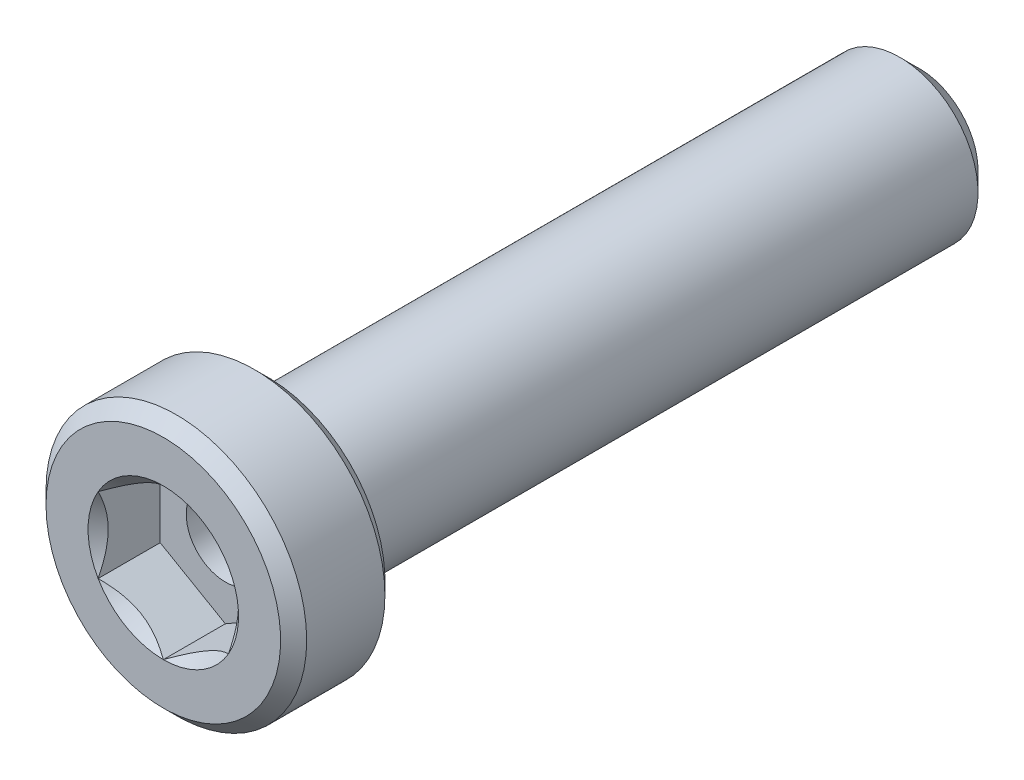
ISO-10303-21;
HEADER;
FILE_DESCRIPTION(('STEP AP214'),'2;1');
FILE_NAME('part.step','',(''),(''),'','','');
FILE_SCHEMA(('AUTOMOTIVE_DESIGN { 1 0 10303 214 1 1 1 1 }'));
ENDSEC;
DATA;
#1=APPLICATION_CONTEXT('core data for automotive mechanical design processes');
#2=APPLICATION_PROTOCOL_DEFINITION('international standard','automotive_design',2000,#1);
#3=PRODUCT_CONTEXT('',#1,'mechanical');
#4=PRODUCT('Part','Part','',(#3));
#5=PRODUCT_RELATED_PRODUCT_CATEGORY('part','',(#4));
#6=PRODUCT_DEFINITION_FORMATION('','',#4);
#7=PRODUCT_DEFINITION_CONTEXT('part definition',#1,'design');
#8=PRODUCT_DEFINITION('design','',#6,#7);
#9=PRODUCT_DEFINITION_SHAPE('','',#8);
#10=(LENGTH_UNIT() NAMED_UNIT(*) SI_UNIT(.MILLI.,.METRE.));
#11=(NAMED_UNIT(*) PLANE_ANGLE_UNIT() SI_UNIT($,.RADIAN.));
#12=(NAMED_UNIT(*) SI_UNIT($,.STERADIAN.) SOLID_ANGLE_UNIT());
#13=UNCERTAINTY_MEASURE_WITH_UNIT(LENGTH_MEASURE(1.E-05),#10,'distance_accuracy_value','');
#14=(GEOMETRIC_REPRESENTATION_CONTEXT(3) GLOBAL_UNCERTAINTY_ASSIGNED_CONTEXT((#13)) GLOBAL_UNIT_ASSIGNED_CONTEXT((#10,
#11,#12)) REPRESENTATION_CONTEXT('',''));
#15=CARTESIAN_POINT('',(0.,0.,0.));
#16=DIRECTION('',(0.,0.,1.));
#17=DIRECTION('',(1.,0.,0.));
#18=AXIS2_PLACEMENT_3D('',#15,#16,#17);
#19=CARTESIAN_POINT('',(0.,0.,29.));
#20=DIRECTION('',(0.,0.,-1.));
#21=DIRECTION('',(-1.,0.,0.));
#22=AXIS2_PLACEMENT_3D('',#19,#20,#21);
#23=PLANE('',#22);
#24=CARTESIAN_POINT('',(0.,0.,29.));
#25=DIRECTION('',(0.,0.,1.));
#26=DIRECTION('',(1.,0.,0.));
#27=AXIS2_PLACEMENT_3D('',#24,#25,#26);
#28=CIRCLE('',#27,2.88675134594812);
#29=CARTESIAN_POINT('',(-2.5,1.44337567297406,29.));
#30=VERTEX_POINT('',#29);
#31=CARTESIAN_POINT('',(-2.5,-1.44337567297405,29.));
#32=VERTEX_POINT('',#31);
#33=EDGE_CURVE('E140',#30,#32,#28,.T.);
#34=ORIENTED_EDGE('',*,*,#33,.F.);
#35=CARTESIAN_POINT('',(0.,2.88675134594812,29.));
#36=VERTEX_POINT('',#35);
#37=EDGE_CURVE('E112',#36,#30,#28,.T.);
#38=ORIENTED_EDGE('',*,*,#37,.F.);
#39=CARTESIAN_POINT('',(2.5,1.44337567297405,29.));
#40=VERTEX_POINT('',#39);
#41=EDGE_CURVE('E103',#40,#36,#28,.T.);
#42=ORIENTED_EDGE('',*,*,#41,.F.);
#43=CARTESIAN_POINT('',(2.49999999999999,-1.44337567297407,29.));
#44=VERTEX_POINT('',#43);
#45=EDGE_CURVE('E61',#44,#40,#28,.T.);
#46=ORIENTED_EDGE('',*,*,#45,.F.);
#47=CARTESIAN_POINT('',(0.,-2.88675134594812,29.));
#48=VERTEX_POINT('',#47);
#49=EDGE_CURVE('E68',#48,#44,#28,.T.);
#50=ORIENTED_EDGE('',*,*,#49,.F.);
#51=EDGE_CURVE('E141',#32,#48,#28,.T.);
#52=ORIENTED_EDGE('',*,*,#51,.F.);
#53=EDGE_LOOP('',(#34,#38,#42,#46,#50,#52));
#54=FACE_BOUND('',#53,.T.);
#55=CARTESIAN_POINT('',(0.,0.,29.));
#56=DIRECTION('',(0.,0.,-1.));
#57=DIRECTION('',(-1.,0.,0.));
#58=AXIS2_PLACEMENT_3D('',#55,#56,#57);
#59=CIRCLE('',#58,4.5);
#60=CARTESIAN_POINT('',(-4.5,0.,29.));
#61=VERTEX_POINT('',#60);
#62=EDGE_CURVE('E55',#61,#61,#59,.F.);
#63=ORIENTED_EDGE('',*,*,#62,.T.);
#64=EDGE_LOOP('',(#63));
#65=FACE_BOUND('',#64,.T.);
#66=ADVANCED_FACE('F41',(#54,#65),#23,.F.);
#67=CARTESIAN_POINT('',(0.,0.,25.));
#68=DIRECTION('',(0.,0.,-1.));
#69=DIRECTION('',(-1.,0.,0.));
#70=AXIS2_PLACEMENT_3D('',#67,#68,#69);
#71=CYLINDRICAL_SURFACE('',#70,3.);
#72=CARTESIAN_POINT('',(0.,0.,25.));
#73=DIRECTION('',(0.,0.,-1.));
#74=DIRECTION('',(-1.,0.,0.));
#75=AXIS2_PLACEMENT_3D('',#72,#73,#74);
#76=CIRCLE('',#75,3.);
#77=CARTESIAN_POINT('',(-3.,0.,25.));
#78=VERTEX_POINT('',#77);
#79=EDGE_CURVE('E212',#78,#78,#76,.T.);
#80=ORIENTED_EDGE('',*,*,#79,.T.);
#81=EDGE_LOOP('',(#80));
#82=FACE_BOUND('',#81,.T.);
#83=CARTESIAN_POINT('',(0.,0.,0.750000000000008));
#84=DIRECTION('',(0.,0.,-1.));
#85=DIRECTION('',(-1.,0.,0.));
#86=AXIS2_PLACEMENT_3D('',#83,#84,#85);
#87=CIRCLE('',#86,3.);
#88=CARTESIAN_POINT('',(-3.,0.,0.750000000000008));
#89=VERTEX_POINT('',#88);
#90=EDGE_CURVE('E144',#89,#89,#87,.F.);
#91=ORIENTED_EDGE('',*,*,#90,.T.);
#92=EDGE_LOOP('',(#91));
#93=FACE_BOUND('',#92,.T.);
#94=ADVANCED_FACE('F249',(#82,#93),#71,.T.);
#95=CARTESIAN_POINT('',(0.,0.,25.));
#96=DIRECTION('',(0.,0.,-1.));
#97=DIRECTION('',(-1.,0.,0.));
#98=AXIS2_PLACEMENT_3D('',#95,#96,#97);
#99=PLANE('',#98);
#100=CARTESIAN_POINT('',(0.,0.,25.));
#101=DIRECTION('',(0.,0.,-1.));
#102=DIRECTION('',(-1.,0.,0.));
#103=AXIS2_PLACEMENT_3D('',#100,#101,#102);
#104=CIRCLE('',#103,4.5);
#105=CARTESIAN_POINT('',(-4.5,0.,25.));
#106=VERTEX_POINT('',#105);
#107=EDGE_CURVE('E225',#106,#106,#104,.T.);
#108=ORIENTED_EDGE('',*,*,#107,.T.);
#109=EDGE_LOOP('',(#108));
#110=FACE_BOUND('',#109,.T.);
#111=ORIENTED_EDGE('',*,*,#79,.F.);
#112=EDGE_LOOP('',(#111));
#113=FACE_BOUND('',#112,.T.);
#114=ADVANCED_FACE('F242',(#110,#113),#99,.T.);
#115=CARTESIAN_POINT('',(0.,0.,25.));
#116=DIRECTION('',(0.,0.,-1.));
#117=DIRECTION('',(-1.,0.,0.));
#118=AXIS2_PLACEMENT_3D('',#115,#116,#117);
#119=CYLINDRICAL_SURFACE('',#118,5.);
#120=CARTESIAN_POINT('',(0.,0.,25.5));
#121=DIRECTION('',(0.,0.,-1.));
#122=DIRECTION('',(-1.,0.,0.));
#123=AXIS2_PLACEMENT_3D('',#120,#121,#122);
#124=CIRCLE('',#123,5.);
#125=CARTESIAN_POINT('',(-5.,0.,25.5));
#126=VERTEX_POINT('',#125);
#127=EDGE_CURVE('E231',#126,#126,#124,.F.);
#128=ORIENTED_EDGE('',*,*,#127,.T.);
#129=EDGE_LOOP('',(#128));
#130=FACE_BOUND('',#129,.T.);
#131=CARTESIAN_POINT('',(0.,0.,28.5));
#132=DIRECTION('',(0.,0.,-1.));
#133=DIRECTION('',(-1.,0.,0.));
#134=AXIS2_PLACEMENT_3D('',#131,#132,#133);
#135=CIRCLE('',#134,5.);
#136=CARTESIAN_POINT('',(-5.,0.,28.5));
#137=VERTEX_POINT('',#136);
#138=EDGE_CURVE('E228',#137,#137,#135,.T.);
#139=ORIENTED_EDGE('',*,*,#138,.T.);
#140=EDGE_LOOP('',(#139));
#141=FACE_BOUND('',#140,.T.);
#142=ADVANCED_FACE('F179',(#130,#141),#119,.T.);
#143=CARTESIAN_POINT('',(0.,0.,25.));
#144=DIRECTION('',(0.,0.,1.));
#145=DIRECTION('',(1.,0.,0.));
#146=AXIS2_PLACEMENT_3D('',#143,#144,#145);
#147=CONICAL_SURFACE('',#146,4.5,0.785398163397445);
#148=ORIENTED_EDGE('',*,*,#127,.F.);
#149=EDGE_LOOP('',(#148));
#150=FACE_BOUND('',#149,.T.);
#151=ORIENTED_EDGE('',*,*,#107,.F.);
#152=EDGE_LOOP('',(#151));
#153=FACE_BOUND('',#152,.T.);
#154=ADVANCED_FACE('F238',(#150,#153),#147,.T.);
#155=CARTESIAN_POINT('',(0.,0.,28.5));
#156=DIRECTION('',(0.,0.,-1.));
#157=DIRECTION('',(-1.,0.,0.));
#158=AXIS2_PLACEMENT_3D('',#155,#156,#157);
#159=CONICAL_SURFACE('',#158,5.,0.785398163397455);
#160=ORIENTED_EDGE('',*,*,#62,.F.);
#161=EDGE_LOOP('',(#160));
#162=FACE_BOUND('',#161,.T.);
#163=ORIENTED_EDGE('',*,*,#138,.F.);
#164=EDGE_LOOP('',(#163));
#165=FACE_BOUND('',#164,.T.);
#166=ADVANCED_FACE('F43',(#162,#165),#159,.T.);
#167=CARTESIAN_POINT('',(0.,0.,29.));
#168=DIRECTION('',(0.,0.,1.));
#169=DIRECTION('',(1.,0.,0.));
#170=AXIS2_PLACEMENT_3D('',#167,#168,#169);
#171=CONICAL_SURFACE('',#170,2.88675134594812,0.78539816339745);
#172=ORIENTED_EDGE('',*,*,#37,.T.);
#173=CARTESIAN_POINT('',(0.000200000000000272,2.88686681600197,29.0001154769818));
#174=CARTESIAN_POINT('',(-0.0857382777877645,2.83725032818751,28.9505407053547));
#175=CARTESIAN_POINT('',(-0.173113567275753,2.7868041812811,28.9038774813625));
#176=CARTESIAN_POINT('',(-0.351281456165588,2.6839389026696,28.8184381400383));
#177=CARTESIAN_POINT('',(-0.442091000681075,2.6315099876986,28.779709562406));
#178=CARTESIAN_POINT('',(-0.625204123126921,2.52578957716234,28.7133667038977));
#179=CARTESIAN_POINT('',(-0.71746106452934,2.47252500720904,28.6855856685309));
#180=CARTESIAN_POINT('',(-0.904006008776286,2.3648232334321,28.6427831759107));
#181=CARTESIAN_POINT('',(-0.998288312566283,2.31038931995913,28.6277297666714));
#182=CARTESIAN_POINT('',(-1.16077825829185,2.21657570605387,28.6141477222095));
#183=CARTESIAN_POINT('',(-1.22877596788015,2.17731721011878,28.6121370992408));
#184=CARTESIAN_POINT('',(-1.36466024116922,2.0988643883567,28.6155241171875));
#185=CARTESIAN_POINT('',(-1.43254675755224,2.05967008984862,28.6209243552998));
#186=CARTESIAN_POINT('',(-1.56767878823611,1.98165157555715,28.6388257884025));
#187=CARTESIAN_POINT('',(-1.63492349975356,1.94282782326097,28.6513349270465));
#188=CARTESIAN_POINT('',(-1.7682501008182,1.86585167424616,28.6827675019557));
#189=CARTESIAN_POINT('',(-1.83433207909966,1.82769922629678,28.7016904464968));
#190=CARTESIAN_POINT('',(-2.00359634669127,1.72997445583858,28.7578673614083));
#191=CARTESIAN_POINT('',(-2.10572912222289,1.67100807039231,28.7993558315962));
#192=CARTESIAN_POINT('',(-2.25590641494051,1.58430317001562,28.8693940467231));
#193=CARTESIAN_POINT('',(-2.30539653988261,1.55573003305807,28.8940022521161));
#194=CARTESIAN_POINT('',(-2.40346006383885,1.49911303110426,28.9454618867152));
#195=CARTESIAN_POINT('',(-2.45203400349693,1.47106885396706,28.9723119387794));
#196=CARTESIAN_POINT('',(-2.5002,1.44326020292023,29.0001154769818));
#197=B_SPLINE_CURVE_WITH_KNOTS('',3,(#173,#174,#175,#176,#177,#178,#179,#180,#181,#182,#183,
#184,#185,#186,#187,#188,#189,#190,#191,#192,#193,#194,#195,#196),.UNSPECIFIED.,.F.,.F.,(4,2,2,
2,2,2,2,2,2,2,2,4),(0.,0.333012085133925,0.667964518301398,0.9975970320433,1.32639954393844,
1.56169424147169,1.79707142102083,2.03271213522171,2.26833478775651,2.64260240809533,
2.82922877818864,3.01574133749025),.UNSPECIFIED.);
#198=EDGE_CURVE('E11',#36,#30,#197,.T.);
#199=ORIENTED_EDGE('',*,*,#198,.F.);
#200=EDGE_LOOP('',(#172,#199));
#201=FACE_BOUND('',#200,.T.);
#202=ADVANCED_FACE('F116',(#201),#171,.F.);
#203=ORIENTED_EDGE('',*,*,#33,.T.);
#204=CARTESIAN_POINT('',(-2.5,-2.92879456580669,29.9639417875927));
#205=CARTESIAN_POINT('',(-2.5,-2.85770301641677,29.9098825831826));
#206=CARTESIAN_POINT('',(-2.5,-2.78621908834373,29.8563310969619));
#207=CARTESIAN_POINT('',(-2.5,-2.64230955424784,29.7504726550719));
#208=CARTESIAN_POINT('',(-2.5,-2.56988372138368,29.6981660081171));
#209=CARTESIAN_POINT('',(-2.5,-2.42340362191708,29.5946541352901));
#210=CARTESIAN_POINT('',(-2.5,-2.349341090747,29.5434605655282));
#211=CARTESIAN_POINT('',(-2.5,-2.19996784709222,29.4429340651232));
#212=CARTESIAN_POINT('',(-2.5,-2.12465722241723,29.3936010043772));
#213=CARTESIAN_POINT('',(-2.5,-1.96804948804133,29.2943385315925));
#214=CARTESIAN_POINT('',(-2.5,-1.88666323343907,29.2445490529301));
#215=CARTESIAN_POINT('',(-2.5,-1.72200981318583,29.1481886945951));
#216=CARTESIAN_POINT('',(-2.5,-1.63874289645642,29.1016173922437));
#217=CARTESIAN_POINT('',(-2.5,-1.47028901183766,29.0126706192659));
#218=CARTESIAN_POINT('',(-2.5,-1.38510830258408,28.9702833883845));
#219=CARTESIAN_POINT('',(-2.5,-1.21239094744366,28.8906617498452));
#220=CARTESIAN_POINT('',(-2.5,-1.12485540778954,28.8534249714523));
#221=CARTESIAN_POINT('',(-2.5,-0.955049472812286,28.7884164451804));
#222=CARTESIAN_POINT('',(-2.5,-0.872989231061401,28.7601014079969));
#223=CARTESIAN_POINT('',(-2.5,-0.706849271308375,28.7100482235528));
#224=CARTESIAN_POINT('',(-2.5,-0.622769418784511,28.6883105157117));
#225=CARTESIAN_POINT('',(-2.5,-0.45451521533315,28.6529242801544));
#226=CARTESIAN_POINT('',(-2.5,-0.370371166523683,28.6391340488756));
#227=CARTESIAN_POINT('',(-2.5,-0.201128210675322,28.619918428796));
#228=CARTESIAN_POINT('',(-2.5,-0.116029482947103,28.614491494819));
#229=CARTESIAN_POINT('',(-2.5,0.0509607865927894,28.6124281117893));
#230=CARTESIAN_POINT('',(-2.5,0.132848291448374,28.6154578655436));
#231=CARTESIAN_POINT('',(-2.5,0.295945512200246,28.6293921728174));
#232=CARTESIAN_POINT('',(-2.5,0.377155163033347,28.6402974736682));
#233=CARTESIAN_POINT('',(-2.5,0.539685643898143,28.6695643516382));
#234=CARTESIAN_POINT('',(-2.5,0.620982959605838,28.6880545906742));
#235=CARTESIAN_POINT('',(-2.5,0.781791426415096,28.7314934560458));
#236=CARTESIAN_POINT('',(-2.5,0.86130270879171,28.75644160602));
#237=CARTESIAN_POINT('',(-2.5,1.10941413784377,28.8437314062941));
#238=CARTESIAN_POINT('',(-2.5,1.27456195876355,28.9159211319007));
#239=CARTESIAN_POINT('',(-2.5,1.51624424003748,29.0362818472987));
#240=CARTESIAN_POINT('',(-2.5,1.59594816295093,29.0785091413623));
#241=CARTESIAN_POINT('',(-2.5,1.7535477232254,29.1662206890825));
#242=CARTESIAN_POINT('',(-2.5,1.83144367996105,29.2117043616163));
#243=CARTESIAN_POINT('',(-2.5,1.98181686762348,29.3029521758057));
#244=CARTESIAN_POINT('',(-2.5,2.05437126813919,29.3485905865564));
#245=CARTESIAN_POINT('',(-2.5,2.19823565558587,29.4417977662864));
#246=CARTESIAN_POINT('',(-2.5,2.26954554804632,29.4893666809064));
#247=CARTESIAN_POINT('',(-2.5,2.41050564950509,29.585698296244));
#248=CARTESIAN_POINT('',(-2.5,2.48016461567303,29.6344482359134));
#249=CARTESIAN_POINT('',(-2.5,2.61852899538144,29.733244806918));
#250=CARTESIAN_POINT('',(-2.5,2.68723466617828,29.7832910775463));
#251=CARTESIAN_POINT('',(-2.5,2.75554105126229,29.8338677537706));
#252=B_SPLINE_CURVE_WITH_KNOTS('',3,(#204,#205,#206,#207,#208,#209,#210,#211,#212,#213,#214,
#215,#216,#217,#218,#219,#220,#221,#222,#223,#224,#225,#226,#227,#228,#229,#230,#231,#232,#233,
#234,#235,#236,#237,#238,#239,#240,#241,#242,#243,#244,#245,#246,#247,#248,#249,#250,#251),
.UNSPECIFIED.,.F.,.F.,(4,2,2,2,2,2,2,2,2,2,2,2,2,2,2,2,2,2,2,2,2,2,2,4),(0.,0.267937334057792,
0.535940437193052,0.806017540125908,1.07607572176001,1.36224147775696,1.64836957671823,
1.93366906975033,2.21883680027125,2.47903365205708,2.73924788329326,2.99466624095671,
3.25003740267838,3.49547281289792,3.74093151618992,3.99073839186152,4.24052684602323,
4.77955840862219,5.05013328014322,5.32065998551818,5.57777294034709,5.83490532844403,
6.089958822182,6.34494209333873),.UNSPECIFIED.);
#253=EDGE_CURVE('E111',#30,#32,#252,.F.);
#254=ORIENTED_EDGE('',*,*,#253,.F.);
#255=EDGE_LOOP('',(#203,#254));
#256=FACE_BOUND('',#255,.T.);
#257=ADVANCED_FACE('F332',(#256),#171,.F.);
#258=ORIENTED_EDGE('',*,*,#51,.T.);
#259=CARTESIAN_POINT('',(-2.5002,-1.44326020292023,29.0001154769818));
#260=CARTESIAN_POINT('',(-2.41426172221224,-1.49287669073469,28.9505407053547));
#261=CARTESIAN_POINT('',(-2.32688643272425,-1.5433228376411,28.9038774813625));
#262=CARTESIAN_POINT('',(-2.14871854383441,-1.64618811625259,28.8184381400383));
#263=CARTESIAN_POINT('',(-2.05790899931893,-1.69861703122359,28.779709562406));
#264=CARTESIAN_POINT('',(-1.87479587687308,-1.80433744175986,28.7133667038977));
#265=CARTESIAN_POINT('',(-1.78253893547066,-1.85760201171315,28.6855856685309));
#266=CARTESIAN_POINT('',(-1.59599399122372,-1.96530378549009,28.6427831759107));
#267=CARTESIAN_POINT('',(-1.50171168743372,-2.01973769896307,28.6277297666714));
#268=CARTESIAN_POINT('',(-1.33922174170816,-2.11355131286833,28.6141477222095));
#269=CARTESIAN_POINT('',(-1.27122403211985,-2.15280980880341,28.6121370992408));
#270=CARTESIAN_POINT('',(-1.13533975883078,-2.23126263056549,28.6155241171875));
#271=CARTESIAN_POINT('',(-1.06745324244776,-2.27045692907358,28.6209243552998));
#272=CARTESIAN_POINT('',(-0.932321211763894,-2.34847544336505,28.6388257884025));
#273=CARTESIAN_POINT('',(-0.86507650024644,-2.38729919566123,28.6513349270465));
#274=CARTESIAN_POINT('',(-0.731749899181801,-2.46427534467604,28.6827675019557));
#275=CARTESIAN_POINT('',(-0.665667920900343,-2.50242779262542,28.7016904464968));
#276=CARTESIAN_POINT('',(-0.496403653308736,-2.60015256308362,28.7578673614083));
#277=CARTESIAN_POINT('',(-0.394270877777107,-2.65911894852989,28.7993558315962));
#278=CARTESIAN_POINT('',(-0.244093585059491,-2.74582384890657,28.8693940467231));
#279=CARTESIAN_POINT('',(-0.194603460117391,-2.77439698586412,28.8940022521161));
#280=CARTESIAN_POINT('',(-0.0965399361611531,-2.83101398781794,28.9454618867152));
#281=CARTESIAN_POINT('',(-0.0479659965030717,-2.85905816495513,28.9723119387794));
#282=CARTESIAN_POINT('',(0.000200000000000171,-2.88686681600197,29.0001154769818));
#283=B_SPLINE_CURVE_WITH_KNOTS('',3,(#259,#260,#261,#262,#263,#264,#265,#266,#267,#268,#269,
#270,#271,#272,#273,#274,#275,#276,#277,#278,#279,#280,#281,#282),.UNSPECIFIED.,.F.,.F.,(4,2,2,
2,2,2,2,2,2,2,2,4),(0.,0.333012085133924,0.667964518301397,0.997597032043299,1.32639954393844,
1.56169424147169,1.79707142102083,2.03271213522171,2.26833478775651,2.64260240809533,
2.82922877818864,3.01574133749025),.UNSPECIFIED.);
#284=EDGE_CURVE('E153',#32,#48,#283,.T.);
#285=ORIENTED_EDGE('',*,*,#284,.F.);
#286=EDGE_LOOP('',(#258,#285));
#287=FACE_BOUND('',#286,.T.);
#288=ADVANCED_FACE('F340',(#287),#171,.F.);
#289=ORIENTED_EDGE('',*,*,#49,.T.);
#290=CARTESIAN_POINT('',(-0.00020000000000085,-2.88686681600197,29.0001154769818));
#291=CARTESIAN_POINT('',(0.0857382777877639,-2.83725032818751,28.9505407053547));
#292=CARTESIAN_POINT('',(0.173113567275753,-2.7868041812811,28.9038774813625));
#293=CARTESIAN_POINT('',(0.351281456165588,-2.6839389026696,28.8184381400383));
#294=CARTESIAN_POINT('',(0.442091000681075,-2.6315099876986,28.779709562406));
#295=CARTESIAN_POINT('',(0.625204123126921,-2.52578957716234,28.7133667038977));
#296=CARTESIAN_POINT('',(0.717461064529341,-2.47252500720904,28.6855856685309));
#297=CARTESIAN_POINT('',(0.904006008776286,-2.3648232334321,28.6427831759107));
#298=CARTESIAN_POINT('',(0.998288312566283,-2.31038931995913,28.6277297666714));
#299=CARTESIAN_POINT('',(1.16077825829184,-2.21657570605387,28.6141477222095));
#300=CARTESIAN_POINT('',(1.22877596788015,-2.17731721011878,28.6121370992408));
#301=CARTESIAN_POINT('',(1.36466024116922,-2.0988643883567,28.6155241171875));
#302=CARTESIAN_POINT('',(1.43254675755224,-2.05967008984862,28.6209243552998));
#303=CARTESIAN_POINT('',(1.56767878823611,-1.98165157555715,28.6388257884025));
#304=CARTESIAN_POINT('',(1.63492349975356,-1.94282782326097,28.6513349270465));
#305=CARTESIAN_POINT('',(1.7682501008182,-1.86585167424616,28.6827675019557));
#306=CARTESIAN_POINT('',(1.83433207909966,-1.82769922629678,28.7016904464968));
#307=CARTESIAN_POINT('',(2.00359634669126,-1.72997445583858,28.7578673614083));
#308=CARTESIAN_POINT('',(2.10572912222289,-1.67100807039231,28.7993558315962));
#309=CARTESIAN_POINT('',(2.25590641494051,-1.58430317001562,28.8693940467231));
#310=CARTESIAN_POINT('',(2.30539653988261,-1.55573003305807,28.8940022521161));
#311=CARTESIAN_POINT('',(2.40346006383885,-1.49911303110426,28.9454618867152));
#312=CARTESIAN_POINT('',(2.45203400349693,-1.47106885396706,28.9723119387794));
#313=CARTESIAN_POINT('',(2.5002,-1.44326020292023,29.0001154769818));
#314=B_SPLINE_CURVE_WITH_KNOTS('',3,(#290,#291,#292,#293,#294,#295,#296,#297,#298,#299,#300,
#301,#302,#303,#304,#305,#306,#307,#308,#309,#310,#311,#312,#313),.UNSPECIFIED.,.F.,.F.,(4,2,2,
2,2,2,2,2,2,2,2,4),(0.,0.333012085133925,0.667964518301399,0.997597032043301,1.32639954393844,
1.56169424147169,1.79707142102083,2.03271213522171,2.26833478775651,2.64260240809533,
2.82922877818864,3.01574133749025),.UNSPECIFIED.);
#315=EDGE_CURVE('E390',#48,#44,#314,.T.);
#316=ORIENTED_EDGE('',*,*,#315,.F.);
#317=EDGE_LOOP('',(#289,#316));
#318=FACE_BOUND('',#317,.T.);
#319=ADVANCED_FACE('F349',(#318),#171,.F.);
#320=ORIENTED_EDGE('',*,*,#45,.T.);
#321=CARTESIAN_POINT('',(2.5,-2.92879456580669,29.9639417875927));
#322=CARTESIAN_POINT('',(2.5,-2.85770301641677,29.9098825831826));
#323=CARTESIAN_POINT('',(2.5,-2.78621908834373,29.8563310969619));
#324=CARTESIAN_POINT('',(2.5,-2.64230955424784,29.7504726550719));
#325=CARTESIAN_POINT('',(2.5,-2.56988372138368,29.6981660081171));
#326=CARTESIAN_POINT('',(2.5,-2.42340362191708,29.5946541352901));
#327=CARTESIAN_POINT('',(2.5,-2.349341090747,29.5434605655282));
#328=CARTESIAN_POINT('',(2.5,-2.19996784709223,29.4429340651232));
#329=CARTESIAN_POINT('',(2.5,-2.12465722241723,29.3936010043772));
#330=CARTESIAN_POINT('',(2.5,-1.96804948804133,29.2943385315925));
#331=CARTESIAN_POINT('',(2.5,-1.88666323343908,29.2445490529301));
#332=CARTESIAN_POINT('',(2.5,-1.72200981318583,29.1481886945951));
#333=CARTESIAN_POINT('',(2.5,-1.63874289645642,29.1016173922437));
#334=CARTESIAN_POINT('',(2.5,-1.47028901183767,29.0126706192659));
#335=CARTESIAN_POINT('',(2.5,-1.38510830258409,28.9702833883845));
#336=CARTESIAN_POINT('',(2.5,-1.21239094744366,28.8906617498452));
#337=CARTESIAN_POINT('',(2.5,-1.12485540778955,28.8534249714523));
#338=CARTESIAN_POINT('',(2.5,-0.955049472812289,28.7884164451804));
#339=CARTESIAN_POINT('',(2.5,-0.872989231061403,28.7601014079969));
#340=CARTESIAN_POINT('',(2.5,-0.706849271308376,28.7100482235528));
#341=CARTESIAN_POINT('',(2.5,-0.622769418784511,28.6883105157117));
#342=CARTESIAN_POINT('',(2.5,-0.454515215333149,28.6529242801544));
#343=CARTESIAN_POINT('',(2.5,-0.370371166523682,28.6391340488756));
#344=CARTESIAN_POINT('',(2.5,-0.201128210675319,28.619918428796));
#345=CARTESIAN_POINT('',(2.5,-0.116029482947099,28.614491494819));
#346=CARTESIAN_POINT('',(2.5,0.050960786592793,28.6124281117893));
#347=CARTESIAN_POINT('',(2.5,0.132848291448377,28.6154578655436));
#348=CARTESIAN_POINT('',(2.5,0.29594551220025,28.6293921728174));
#349=CARTESIAN_POINT('',(2.5,0.37715516303335,28.6402974736682));
#350=CARTESIAN_POINT('',(2.5,0.539685643898146,28.6695643516382));
#351=CARTESIAN_POINT('',(2.5,0.620982959605841,28.6880545906742));
#352=CARTESIAN_POINT('',(2.5,0.7817914264151,28.7314934560458));
#353=CARTESIAN_POINT('',(2.5,0.861302708791713,28.75644160602));
#354=CARTESIAN_POINT('',(2.5,1.10941413784377,28.8437314062941));
#355=CARTESIAN_POINT('',(2.5,1.27456195876356,28.9159211319007));
#356=CARTESIAN_POINT('',(2.5,1.51624424003749,29.0362818472987));
#357=CARTESIAN_POINT('',(2.5,1.59594816295093,29.0785091413623));
#358=CARTESIAN_POINT('',(2.5,1.75354772322541,29.1662206890825));
#359=CARTESIAN_POINT('',(2.5,1.83144367996105,29.2117043616163));
#360=CARTESIAN_POINT('',(2.5,1.98181686762348,29.3029521758057));
#361=CARTESIAN_POINT('',(2.5,2.05437126813919,29.3485905865564));
#362=CARTESIAN_POINT('',(2.5,2.19823565558587,29.4417977662864));
#363=CARTESIAN_POINT('',(2.5,2.26954554804633,29.4893666809064));
#364=CARTESIAN_POINT('',(2.5,2.41050564950509,29.585698296244));
#365=CARTESIAN_POINT('',(2.5,2.48016461567303,29.6344482359134));
#366=CARTESIAN_POINT('',(2.5,2.61852899538144,29.733244806918));
#367=CARTESIAN_POINT('',(2.5,2.68723466617828,29.7832910775464));
#368=CARTESIAN_POINT('',(2.5,2.75554105126229,29.8338677537706));
#369=B_SPLINE_CURVE_WITH_KNOTS('',3,(#321,#322,#323,#324,#325,#326,#327,#328,#329,#330,#331,
#332,#333,#334,#335,#336,#337,#338,#339,#340,#341,#342,#343,#344,#345,#346,#347,#348,#349,#350,
#351,#352,#353,#354,#355,#356,#357,#358,#359,#360,#361,#362,#363,#364,#365,#366,#367,#368),
.UNSPECIFIED.,.F.,.F.,(4,2,2,2,2,2,2,2,2,2,2,2,2,2,2,2,2,2,2,2,2,2,2,4),(0.,0.267937334057791,
0.535940437193048,0.806017540125903,1.07607572176,1.36224147775696,1.64836957671823,
1.93366906975032,2.21883680027124,2.47903365205707,2.73924788329326,2.99466624095671,
3.25003740267838,3.49547281289792,3.74093151618992,3.99073839186153,4.24052684602323,
4.7795584086222,5.05013328014322,5.32065998551818,5.5777729403471,5.83490532844404,
6.089958822182,6.34494209333873),.UNSPECIFIED.);
#370=EDGE_CURVE('E128',#44,#40,#369,.T.);
#371=ORIENTED_EDGE('',*,*,#370,.F.);
#372=EDGE_LOOP('',(#320,#371));
#373=FACE_BOUND('',#372,.T.);
#374=ADVANCED_FACE('F358',(#373),#171,.F.);
#375=ORIENTED_EDGE('',*,*,#41,.T.);
#376=CARTESIAN_POINT('',(2.5002,1.44326020292023,29.0001154769818));
#377=CARTESIAN_POINT('',(2.41426172221224,1.49287669073469,28.9505407053547));
#378=CARTESIAN_POINT('',(2.32688643272425,1.5433228376411,28.9038774813625));
#379=CARTESIAN_POINT('',(2.14871854383441,1.64618811625259,28.8184381400383));
#380=CARTESIAN_POINT('',(2.05790899931892,1.6986170312236,28.779709562406));
#381=CARTESIAN_POINT('',(1.87479587687308,1.80433744175986,28.7133667038977));
#382=CARTESIAN_POINT('',(1.78253893547066,1.85760201171316,28.6855856685309));
#383=CARTESIAN_POINT('',(1.59599399122371,1.96530378549009,28.6427831759107));
#384=CARTESIAN_POINT('',(1.50171168743372,2.01973769896307,28.6277297666714));
#385=CARTESIAN_POINT('',(1.33922174170815,2.11355131286833,28.6141477222095));
#386=CARTESIAN_POINT('',(1.27122403211985,2.15280980880341,28.6121370992408));
#387=CARTESIAN_POINT('',(1.13533975883078,2.23126263056549,28.6155241171875));
#388=CARTESIAN_POINT('',(1.06745324244776,2.27045692907358,28.6209243552998));
#389=CARTESIAN_POINT('',(0.932321211763892,2.34847544336505,28.6388257884025));
#390=CARTESIAN_POINT('',(0.865076500246437,2.38729919566123,28.6513349270465));
#391=CARTESIAN_POINT('',(0.731749899181799,2.46427534467604,28.6827675019557));
#392=CARTESIAN_POINT('',(0.66566792090034,2.50242779262542,28.7016904464968));
#393=CARTESIAN_POINT('',(0.496403653308733,2.60015256308362,28.7578673614083));
#394=CARTESIAN_POINT('',(0.394270877777105,2.65911894852989,28.7993558315962));
#395=CARTESIAN_POINT('',(0.24409358505949,2.74582384890657,28.8693940467231));
#396=CARTESIAN_POINT('',(0.19460346011739,2.77439698586412,28.8940022521161));
#397=CARTESIAN_POINT('',(0.0965399361611523,2.83101398781794,28.9454618867152));
#398=CARTESIAN_POINT('',(0.0479659965030711,2.85905816495513,28.9723119387794));
#399=CARTESIAN_POINT('',(-0.00020000000000066,2.88686681600197,29.0001154769818));
#400=B_SPLINE_CURVE_WITH_KNOTS('',3,(#376,#377,#378,#379,#380,#381,#382,#383,#384,#385,#386,
#387,#388,#389,#390,#391,#392,#393,#394,#395,#396,#397,#398,#399),.UNSPECIFIED.,.F.,.F.,(4,2,2,
2,2,2,2,2,2,2,2,4),(0.,0.333012085133925,0.667964518301399,0.997597032043302,1.32639954393845,
1.56169424147169,1.79707142102083,2.03271213522171,2.26833478775651,2.64260240809533,
2.82922877818864,3.01574133749025),.UNSPECIFIED.);
#401=EDGE_CURVE('E107',#40,#36,#400,.T.);
#402=ORIENTED_EDGE('',*,*,#401,.F.);
#403=EDGE_LOOP('',(#375,#402));
#404=FACE_BOUND('',#403,.T.);
#405=ADVANCED_FACE('F105',(#404),#171,.F.);
#406=CARTESIAN_POINT('',(0.,0.,24.9394614872325));
#407=DIRECTION('',(0.,0.,1.));
#408=DIRECTION('',(0.,-1.,0.));
#409=AXIS2_PLACEMENT_3D('',#406,#407,#408);
#410=CONICAL_SURFACE('',#409,1.5,1.13446401379632);
#411=CARTESIAN_POINT('',(0.,0.,24.24));
#412=VERTEX_POINT('',#411);
#413=VERTEX_LOOP('',#412);
#414=FACE_BOUND('',#413,.T.);
#415=CARTESIAN_POINT('',(0.,0.,24.9394614872325));
#416=DIRECTION('',(0.,0.,1.));
#417=DIRECTION('',(0.,-1.,0.));
#418=AXIS2_PLACEMENT_3D('',#415,#416,#417);
#419=CIRCLE('',#418,1.5);
#420=CARTESIAN_POINT('',(0.,-1.5,24.9394614872325));
#421=VERTEX_POINT('',#420);
#422=EDGE_CURVE('E194',#421,#421,#419,.T.);
#423=ORIENTED_EDGE('',*,*,#422,.T.);
#424=EDGE_LOOP('',(#423));
#425=FACE_BOUND('',#424,.T.);
#426=ADVANCED_FACE('F311',(#414,#425),#410,.F.);
#427=CARTESIAN_POINT('',(0.,0.,26.62));
#428=DIRECTION('',(0.,0.,1.));
#429=DIRECTION('',(0.,-1.,0.));
#430=AXIS2_PLACEMENT_3D('',#427,#428,#429);
#431=CYLINDRICAL_SURFACE('',#430,1.5);
#432=ORIENTED_EDGE('',*,*,#422,.F.);
#433=EDGE_LOOP('',(#432));
#434=FACE_BOUND('',#433,.T.);
#435=CARTESIAN_POINT('',(0.,0.,26.62));
#436=DIRECTION('',(0.,0.,1.));
#437=DIRECTION('',(0.,-1.,0.));
#438=AXIS2_PLACEMENT_3D('',#435,#436,#437);
#439=CIRCLE('',#438,1.5);
#440=CARTESIAN_POINT('',(0.,-1.5,26.62));
#441=VERTEX_POINT('',#440);
#442=EDGE_CURVE('E127',#441,#441,#439,.T.);
#443=ORIENTED_EDGE('',*,*,#442,.T.);
#444=EDGE_LOOP('',(#443));
#445=FACE_BOUND('',#444,.T.);
#446=ADVANCED_FACE('F303',(#434,#445),#431,.F.);
#447=CARTESIAN_POINT('',(0.,0.,26.62));
#448=DIRECTION('',(0.,0.,1.));
#449=DIRECTION('',(1.,0.,0.));
#450=AXIS2_PLACEMENT_3D('',#447,#448,#449);
#451=PLANE('',#450);
#452=ORIENTED_EDGE('',*,*,#442,.F.);
#453=EDGE_LOOP('',(#452));
#454=FACE_BOUND('',#453,.T.);
#455=DIRECTION('',(-0.866025403784439,0.5,0.));
#456=VECTOR('',#455,1.);
#457=CARTESIAN_POINT('',(2.5,1.44337567297407,26.62));
#458=LINE('',#457,#456);
#459=CARTESIAN_POINT('',(2.5,1.44337567297407,26.62));
#460=VERTEX_POINT('',#459);
#461=CARTESIAN_POINT('',(0.,2.88675134594813,26.62));
#462=VERTEX_POINT('',#461);
#463=EDGE_CURVE('E197',#460,#462,#458,.T.);
#464=ORIENTED_EDGE('',*,*,#463,.T.);
#465=DIRECTION('',(-0.866025403784439,-0.5,0.));
#466=VECTOR('',#465,1.);
#467=CARTESIAN_POINT('',(0.,2.88675134594813,26.62));
#468=LINE('',#467,#466);
#469=CARTESIAN_POINT('',(-2.5,1.44337567297406,26.62));
#470=VERTEX_POINT('',#469);
#471=EDGE_CURVE('E132',#462,#470,#468,.T.);
#472=ORIENTED_EDGE('',*,*,#471,.T.);
#473=DIRECTION('',(0.,-1.,0.));
#474=VECTOR('',#473,1.);
#475=CARTESIAN_POINT('',(-2.5,1.44337567297406,26.62));
#476=LINE('',#475,#474);
#477=CARTESIAN_POINT('',(-2.5,-1.44337567297407,26.62));
#478=VERTEX_POINT('',#477);
#479=EDGE_CURVE('E200',#470,#478,#476,.T.);
#480=ORIENTED_EDGE('',*,*,#479,.T.);
#481=DIRECTION('',(0.866025403784439,-0.5,0.));
#482=VECTOR('',#481,1.);
#483=CARTESIAN_POINT('',(-2.5,-1.44337567297407,26.62));
#484=LINE('',#483,#482);
#485=CARTESIAN_POINT('',(0.,-2.88675134594813,26.62));
#486=VERTEX_POINT('',#485);
#487=EDGE_CURVE('E203',#478,#486,#484,.T.);
#488=ORIENTED_EDGE('',*,*,#487,.T.);
#489=DIRECTION('',(0.866025403784439,0.5,0.));
#490=VECTOR('',#489,1.);
#491=CARTESIAN_POINT('',(0.,-2.88675134594813,26.62));
#492=LINE('',#491,#490);
#493=CARTESIAN_POINT('',(2.5,-1.44337567297407,26.62));
#494=VERTEX_POINT('',#493);
#495=EDGE_CURVE('E206',#486,#494,#492,.T.);
#496=ORIENTED_EDGE('',*,*,#495,.T.);
#497=DIRECTION('',(0.,1.,0.));
#498=VECTOR('',#497,1.);
#499=CARTESIAN_POINT('',(2.5,-1.44337567297407,26.62));
#500=LINE('',#499,#498);
#501=EDGE_CURVE('E135',#494,#460,#500,.T.);
#502=ORIENTED_EDGE('',*,*,#501,.T.);
#503=EDGE_LOOP('',(#464,#472,#480,#488,#496,#502));
#504=FACE_BOUND('',#503,.T.);
#505=ADVANCED_FACE('F173',(#454,#504),#451,.T.);
#506=CARTESIAN_POINT('',(0.,2.88675134594813,26.62));
#507=DIRECTION('',(-0.5,0.866025403784438,0.));
#508=DIRECTION('',(-0.866025403784439,-0.5,0.));
#509=AXIS2_PLACEMENT_3D('',#506,#507,#508);
#510=PLANE('',#509);
#511=DIRECTION('',(0.,0.,1.));
#512=VECTOR('',#511,1.);
#513=CARTESIAN_POINT('',(0.,2.88675134594813,26.62));
#514=LINE('',#513,#512);
#515=EDGE_CURVE('E124',#462,#36,#514,.T.);
#516=ORIENTED_EDGE('',*,*,#515,.T.);
#517=ORIENTED_EDGE('',*,*,#198,.T.);
#518=DIRECTION('',(0.,0.,1.));
#519=VECTOR('',#518,1.);
#520=CARTESIAN_POINT('',(-2.5,1.44337567297406,26.62));
#521=LINE('',#520,#519);
#522=EDGE_CURVE('E134',#470,#30,#521,.T.);
#523=ORIENTED_EDGE('',*,*,#522,.F.);
#524=ORIENTED_EDGE('',*,*,#471,.F.);
#525=EDGE_LOOP('',(#516,#517,#523,#524));
#526=FACE_BOUND('',#525,.T.);
#527=ADVANCED_FACE('F130',(#526),#510,.F.);
#528=CARTESIAN_POINT('',(-2.5,1.44337567297406,26.62));
#529=DIRECTION('',(-1.,0.,0.));
#530=DIRECTION('',(0.,0.,1.));
#531=AXIS2_PLACEMENT_3D('',#528,#529,#530);
#532=PLANE('',#531);
#533=ORIENTED_EDGE('',*,*,#522,.T.);
#534=ORIENTED_EDGE('',*,*,#253,.T.);
#535=DIRECTION('',(0.,0.,1.));
#536=VECTOR('',#535,1.);
#537=CARTESIAN_POINT('',(-2.5,-1.44337567297407,26.62));
#538=LINE('',#537,#536);
#539=EDGE_CURVE('E219',#478,#32,#538,.T.);
#540=ORIENTED_EDGE('',*,*,#539,.F.);
#541=ORIENTED_EDGE('',*,*,#479,.F.);
#542=EDGE_LOOP('',(#533,#534,#540,#541));
#543=FACE_BOUND('',#542,.T.);
#544=ADVANCED_FACE('F163',(#543),#532,.F.);
#545=CARTESIAN_POINT('',(-2.5,-1.44337567297407,26.62));
#546=DIRECTION('',(-0.5,-0.866025403784439,0.));
#547=DIRECTION('',(0.866025403784439,-0.5,0.));
#548=AXIS2_PLACEMENT_3D('',#545,#546,#547);
#549=PLANE('',#548);
#550=ORIENTED_EDGE('',*,*,#539,.T.);
#551=ORIENTED_EDGE('',*,*,#284,.T.);
#552=DIRECTION('',(0.,0.,1.));
#553=VECTOR('',#552,1.);
#554=CARTESIAN_POINT('',(0.,-2.88675134594813,26.62));
#555=LINE('',#554,#553);
#556=EDGE_CURVE('E216',#486,#48,#555,.T.);
#557=ORIENTED_EDGE('',*,*,#556,.F.);
#558=ORIENTED_EDGE('',*,*,#487,.F.);
#559=EDGE_LOOP('',(#550,#551,#557,#558));
#560=FACE_BOUND('',#559,.T.);
#561=ADVANCED_FACE('F166',(#560),#549,.F.);
#562=CARTESIAN_POINT('',(0.,-2.88675134594813,26.62));
#563=DIRECTION('',(0.5,-0.866025403784439,0.));
#564=DIRECTION('',(0.866025403784439,0.5,0.));
#565=AXIS2_PLACEMENT_3D('',#562,#563,#564);
#566=PLANE('',#565);
#567=ORIENTED_EDGE('',*,*,#556,.T.);
#568=ORIENTED_EDGE('',*,*,#315,.T.);
#569=DIRECTION('',(0.,0.,1.));
#570=VECTOR('',#569,1.);
#571=CARTESIAN_POINT('',(2.5,-1.44337567297407,26.62));
#572=LINE('',#571,#570);
#573=EDGE_CURVE('E213',#494,#44,#572,.T.);
#574=ORIENTED_EDGE('',*,*,#573,.F.);
#575=ORIENTED_EDGE('',*,*,#495,.F.);
#576=EDGE_LOOP('',(#567,#568,#574,#575));
#577=FACE_BOUND('',#576,.T.);
#578=ADVANCED_FACE('F395',(#577),#566,.F.);
#579=CARTESIAN_POINT('',(2.5,-1.44337567297407,26.62));
#580=DIRECTION('',(1.,0.,0.));
#581=DIRECTION('',(0.,0.,-1.));
#582=AXIS2_PLACEMENT_3D('',#579,#580,#581);
#583=PLANE('',#582);
#584=ORIENTED_EDGE('',*,*,#573,.T.);
#585=ORIENTED_EDGE('',*,*,#370,.T.);
#586=DIRECTION('',(0.,0.,1.));
#587=VECTOR('',#586,1.);
#588=CARTESIAN_POINT('',(2.5,1.44337567297407,26.62));
#589=LINE('',#588,#587);
#590=EDGE_CURVE('E126',#460,#40,#589,.T.);
#591=ORIENTED_EDGE('',*,*,#590,.F.);
#592=ORIENTED_EDGE('',*,*,#501,.F.);
#593=EDGE_LOOP('',(#584,#585,#591,#592));
#594=FACE_BOUND('',#593,.T.);
#595=ADVANCED_FACE('F178',(#594),#583,.F.);
#596=CARTESIAN_POINT('',(2.5,1.44337567297407,26.62));
#597=DIRECTION('',(0.5,0.866025403784439,0.));
#598=DIRECTION('',(-0.866025403784439,0.5,0.));
#599=AXIS2_PLACEMENT_3D('',#596,#597,#598);
#600=PLANE('',#599);
#601=ORIENTED_EDGE('',*,*,#590,.T.);
#602=ORIENTED_EDGE('',*,*,#401,.T.);
#603=ORIENTED_EDGE('',*,*,#515,.F.);
#604=ORIENTED_EDGE('',*,*,#463,.F.);
#605=EDGE_LOOP('',(#601,#602,#603,#604));
#606=FACE_BOUND('',#605,.T.);
#607=ADVANCED_FACE('F122',(#606),#600,.F.);
#608=CARTESIAN_POINT('',(0.,0.,0.));
#609=DIRECTION('',(0.,0.,-1.));
#610=DIRECTION('',(-1.,0.,0.));
#611=AXIS2_PLACEMENT_3D('',#608,#609,#610);
#612=PLANE('',#611);
#613=CARTESIAN_POINT('',(0.,0.,0.));
#614=DIRECTION('',(0.,0.,-1.));
#615=DIRECTION('',(-1.,0.,0.));
#616=AXIS2_PLACEMENT_3D('',#613,#614,#615);
#617=CIRCLE('',#616,2.25);
#618=CARTESIAN_POINT('',(-2.25,0.,0.));
#619=VERTEX_POINT('',#618);
#620=EDGE_CURVE('E263',#619,#619,#617,.T.);
#621=ORIENTED_EDGE('',*,*,#620,.T.);
#622=EDGE_LOOP('',(#621));
#623=FACE_BOUND('',#622,.T.);
#624=ADVANCED_FACE('F177',(#623),#612,.T.);
#625=CARTESIAN_POINT('',(0.,0.,0.));
#626=DIRECTION('',(0.,0.,1.));
#627=DIRECTION('',(1.,0.,0.));
#628=AXIS2_PLACEMENT_3D('',#625,#626,#627);
#629=CONICAL_SURFACE('',#628,2.25,0.785398163397445);
#630=ORIENTED_EDGE('',*,*,#90,.F.);
#631=EDGE_LOOP('',(#630));
#632=FACE_BOUND('',#631,.T.);
#633=ORIENTED_EDGE('',*,*,#620,.F.);
#634=EDGE_LOOP('',(#633));
#635=FACE_BOUND('',#634,.T.);
#636=ADVANCED_FACE('F268',(#632,#635),#629,.T.);
#637=CLOSED_SHELL('',(#66,#94,#114,#142,#154,#166,#202,#257,#288,#319,#374,#405,#426,#446,#505,
#527,#544,#561,#578,#595,#607,#624,#636));
#638=MANIFOLD_SOLID_BREP('B2',#637);
#639=ADVANCED_BREP_SHAPE_REPRESENTATION('',(#18,#638),#14);
#640=SHAPE_DEFINITION_REPRESENTATION(#9,#639);
ENDSEC;
END-ISO-10303-21;
